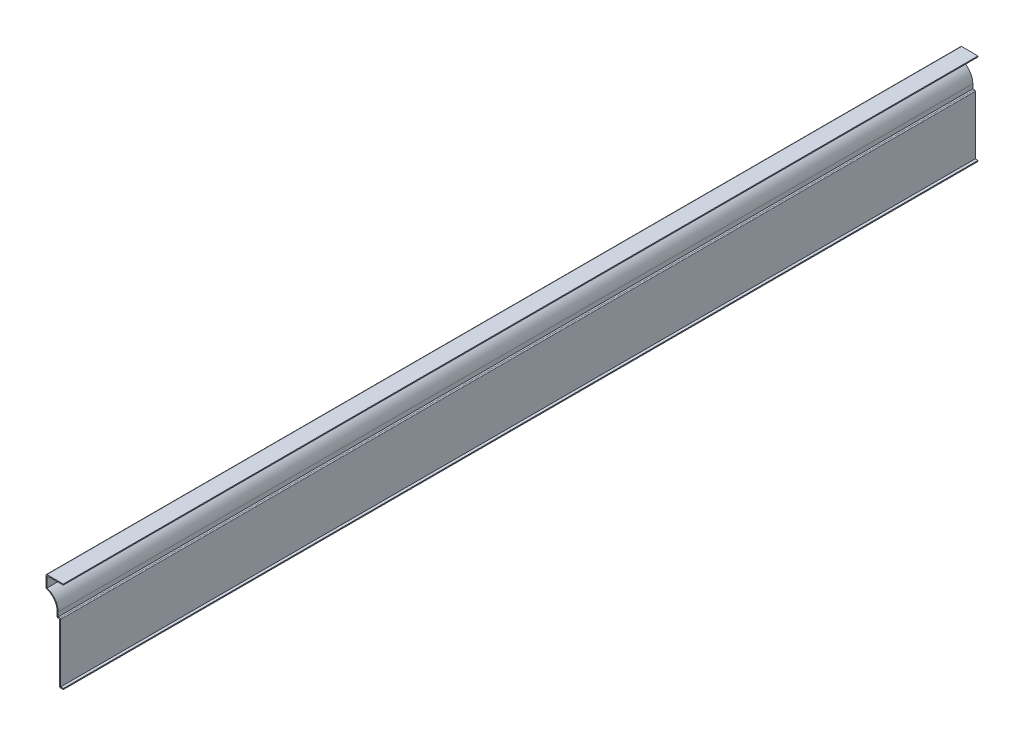
ISO-10303-21;
HEADER;
FILE_DESCRIPTION(('STEP AP214'),'2;1');
FILE_NAME('part.step','',(''),(''),'','','');
FILE_SCHEMA(('AUTOMOTIVE_DESIGN { 1 0 10303 214 1 1 1 1 }'));
ENDSEC;
DATA;
#1=APPLICATION_CONTEXT('core data for automotive mechanical design processes');
#2=APPLICATION_PROTOCOL_DEFINITION('international standard','automotive_design',2000,#1);
#3=PRODUCT_CONTEXT('',#1,'mechanical');
#4=PRODUCT('Part','Part','',(#3));
#5=PRODUCT_RELATED_PRODUCT_CATEGORY('part','',(#4));
#6=PRODUCT_DEFINITION_FORMATION('','',#4);
#7=PRODUCT_DEFINITION_CONTEXT('part definition',#1,'design');
#8=PRODUCT_DEFINITION('design','',#6,#7);
#9=PRODUCT_DEFINITION_SHAPE('','',#8);
#10=(LENGTH_UNIT() NAMED_UNIT(*) SI_UNIT(.MILLI.,.METRE.));
#11=(NAMED_UNIT(*) PLANE_ANGLE_UNIT() SI_UNIT($,.RADIAN.));
#12=(NAMED_UNIT(*) SI_UNIT($,.STERADIAN.) SOLID_ANGLE_UNIT());
#13=UNCERTAINTY_MEASURE_WITH_UNIT(LENGTH_MEASURE(1.E-05),#10,'distance_accuracy_value','');
#14=(GEOMETRIC_REPRESENTATION_CONTEXT(3) GLOBAL_UNCERTAINTY_ASSIGNED_CONTEXT((#13)) GLOBAL_UNIT_ASSIGNED_CONTEXT((#10,
#11,#12)) REPRESENTATION_CONTEXT('',''));
#15=CARTESIAN_POINT('',(0.,0.,0.));
#16=DIRECTION('',(0.,0.,1.));
#17=DIRECTION('',(1.,0.,0.));
#18=AXIS2_PLACEMENT_3D('',#15,#16,#17);
#19=CARTESIAN_POINT('',(-22.225,116.205,-1174.75));
#20=DIRECTION('',(0.,-1.,0.));
#21=DIRECTION('',(1.,0.,0.));
#22=AXIS2_PLACEMENT_3D('',#19,#20,#21);
#23=PLANE('',#22);
#24=DIRECTION('',(1.,0.,0.));
#25=VECTOR('',#24,1.);
#26=CARTESIAN_POINT('',(-22.225,116.205,0.));
#27=LINE('',#26,#25);
#28=CARTESIAN_POINT('',(-20.955,116.205,0.));
#29=VERTEX_POINT('',#28);
#30=CARTESIAN_POINT('',(0.,116.205,0.));
#31=VERTEX_POINT('',#30);
#32=EDGE_CURVE('E242',#29,#31,#27,.T.);
#33=ORIENTED_EDGE('',*,*,#32,.F.);
#34=DIRECTION('',(0.,0.,1.));
#35=VECTOR('',#34,1.);
#36=CARTESIAN_POINT('',(-20.955,116.205,-1174.75));
#37=LINE('',#36,#35);
#38=CARTESIAN_POINT('',(-20.955,116.205,-1174.75));
#39=VERTEX_POINT('',#38);
#40=EDGE_CURVE('E203',#39,#29,#37,.T.);
#41=ORIENTED_EDGE('',*,*,#40,.F.);
#42=DIRECTION('',(1.,0.,0.));
#43=VECTOR('',#42,1.);
#44=CARTESIAN_POINT('',(-22.225,116.205,-1174.75));
#45=LINE('',#44,#43);
#46=CARTESIAN_POINT('',(0.,116.205,-1174.75));
#47=VERTEX_POINT('',#46);
#48=EDGE_CURVE('E185',#39,#47,#45,.T.);
#49=ORIENTED_EDGE('',*,*,#48,.T.);
#50=DIRECTION('',(0.,0.,1.));
#51=VECTOR('',#50,1.);
#52=CARTESIAN_POINT('',(0.,116.205,-1174.75));
#53=LINE('',#52,#51);
#54=EDGE_CURVE('E193',#47,#31,#53,.T.);
#55=ORIENTED_EDGE('',*,*,#54,.T.);
#56=EDGE_LOOP('',(#33,#41,#49,#55));
#57=FACE_BOUND('',#56,.T.);
#58=ADVANCED_FACE('F35',(#57),#23,.T.);
#59=CARTESIAN_POINT('',(-20.955,101.6,-1174.75));
#60=DIRECTION('',(1.,0.,0.));
#61=DIRECTION('',(0.,0.,-1.));
#62=AXIS2_PLACEMENT_3D('',#59,#60,#61);
#63=PLANE('',#62);
#64=DIRECTION('',(0.,1.,0.));
#65=VECTOR('',#64,1.);
#66=CARTESIAN_POINT('',(-20.955,101.6,0.));
#67=LINE('',#66,#65);
#68=CARTESIAN_POINT('',(-20.955,102.558817033746,0.));
#69=VERTEX_POINT('',#68);
#70=EDGE_CURVE('E204',#69,#29,#67,.T.);
#71=ORIENTED_EDGE('',*,*,#70,.F.);
#72=DIRECTION('',(0.,0.,1.));
#73=VECTOR('',#72,1.);
#74=CARTESIAN_POINT('',(-20.955,102.558817033746,-1174.75));
#75=LINE('',#74,#73);
#76=CARTESIAN_POINT('',(-20.955,102.558817033746,-1174.75));
#77=VERTEX_POINT('',#76);
#78=EDGE_CURVE('E279',#77,#69,#75,.T.);
#79=ORIENTED_EDGE('',*,*,#78,.F.);
#80=DIRECTION('',(0.,1.,0.));
#81=VECTOR('',#80,1.);
#82=CARTESIAN_POINT('',(-20.955,101.6,-1174.75));
#83=LINE('',#82,#81);
#84=EDGE_CURVE('E201',#77,#39,#83,.T.);
#85=ORIENTED_EDGE('',*,*,#84,.T.);
#86=ORIENTED_EDGE('',*,*,#40,.T.);
#87=EDGE_LOOP('',(#71,#79,#85,#86));
#88=FACE_BOUND('',#87,.T.);
#89=ADVANCED_FACE('F360',(#88),#63,.T.);
#90=CARTESIAN_POINT('',(-26.9875,83.1549168136872,-1174.75));
#91=DIRECTION('',(0.,0.,1.));
#92=DIRECTION('',(1.,0.,0.));
#93=AXIS2_PLACEMENT_3D('',#90,#91,#92);
#94=CYLINDRICAL_SURFACE('',#93,20.32);
#95=CARTESIAN_POINT('',(-26.9875,83.1549168136872,0.));
#96=DIRECTION('',(0.,0.,1.));
#97=DIRECTION('',(1.,0.,0.));
#98=AXIS2_PLACEMENT_3D('',#95,#96,#97);
#99=CIRCLE('',#98,20.32);
#100=CARTESIAN_POINT('',(-6.6675,83.1549168136872,0.));
#101=VERTEX_POINT('',#100);
#102=EDGE_CURVE('E207',#101,#69,#99,.T.);
#103=ORIENTED_EDGE('',*,*,#102,.F.);
#104=DIRECTION('',(0.,0.,1.));
#105=VECTOR('',#104,1.);
#106=CARTESIAN_POINT('',(-6.6675,83.1549168136872,-1174.75));
#107=LINE('',#106,#105);
#108=CARTESIAN_POINT('',(-6.6675,83.1549168136872,-1174.75));
#109=VERTEX_POINT('',#108);
#110=EDGE_CURVE('E281',#109,#101,#107,.T.);
#111=ORIENTED_EDGE('',*,*,#110,.F.);
#112=CARTESIAN_POINT('',(-26.9875,83.1549168136872,-1174.75));
#113=DIRECTION('',(0.,0.,1.));
#114=DIRECTION('',(1.,0.,0.));
#115=AXIS2_PLACEMENT_3D('',#112,#113,#114);
#116=CIRCLE('',#115,20.32);
#117=EDGE_CURVE('E238',#109,#77,#116,.T.);
#118=ORIENTED_EDGE('',*,*,#117,.T.);
#119=ORIENTED_EDGE('',*,*,#78,.T.);
#120=EDGE_LOOP('',(#103,#111,#118,#119));
#121=FACE_BOUND('',#120,.T.);
#122=ADVANCED_FACE('F428',(#121),#94,.T.);
#123=CARTESIAN_POINT('',(-6.6675,76.2,-1174.75));
#124=DIRECTION('',(1.,0.,0.));
#125=DIRECTION('',(0.,0.,-1.));
#126=AXIS2_PLACEMENT_3D('',#123,#124,#125);
#127=PLANE('',#126);
#128=DIRECTION('',(0.,1.,0.));
#129=VECTOR('',#128,1.);
#130=CARTESIAN_POINT('',(-6.6675,76.2,0.));
#131=LINE('',#130,#129);
#132=CARTESIAN_POINT('',(-6.6675,77.47,0.));
#133=VERTEX_POINT('',#132);
#134=EDGE_CURVE('E272',#133,#101,#131,.T.);
#135=ORIENTED_EDGE('',*,*,#134,.F.);
#136=DIRECTION('',(0.,0.,1.));
#137=VECTOR('',#136,1.);
#138=CARTESIAN_POINT('',(-6.6675,77.47,-1174.75));
#139=LINE('',#138,#137);
#140=CARTESIAN_POINT('',(-6.6675,77.47,-1174.75));
#141=VERTEX_POINT('',#140);
#142=EDGE_CURVE('E283',#141,#133,#139,.T.);
#143=ORIENTED_EDGE('',*,*,#142,.F.);
#144=DIRECTION('',(0.,1.,0.));
#145=VECTOR('',#144,1.);
#146=CARTESIAN_POINT('',(-6.6675,76.2,-1174.75));
#147=LINE('',#146,#145);
#148=EDGE_CURVE('E235',#141,#109,#147,.T.);
#149=ORIENTED_EDGE('',*,*,#148,.T.);
#150=ORIENTED_EDGE('',*,*,#110,.T.);
#151=EDGE_LOOP('',(#135,#143,#149,#150));
#152=FACE_BOUND('',#151,.T.);
#153=ADVANCED_FACE('F368',(#152),#127,.T.);
#154=CARTESIAN_POINT('',(-4.7625,77.47,-1174.75));
#155=DIRECTION('',(0.,1.,0.));
#156=DIRECTION('',(0.,0.,1.));
#157=AXIS2_PLACEMENT_3D('',#154,#155,#156);
#158=PLANE('',#157);
#159=DIRECTION('',(1.,0.,0.));
#160=VECTOR('',#159,1.);
#161=CARTESIAN_POINT('',(-4.7625,77.47,0.));
#162=LINE('',#161,#160);
#163=CARTESIAN_POINT('',(-4.7625,77.47,0.));
#164=VERTEX_POINT('',#163);
#165=EDGE_CURVE('E270',#164,#133,#162,.F.);
#166=ORIENTED_EDGE('',*,*,#165,.F.);
#167=DIRECTION('',(0.,0.,1.));
#168=VECTOR('',#167,1.);
#169=CARTESIAN_POINT('',(-4.7625,77.47,-1174.75));
#170=LINE('',#169,#168);
#171=CARTESIAN_POINT('',(-4.7625,77.47,-1174.75));
#172=VERTEX_POINT('',#171);
#173=EDGE_CURVE('E326',#164,#172,#170,.F.);
#174=ORIENTED_EDGE('',*,*,#173,.T.);
#175=DIRECTION('',(1.,0.,0.));
#176=VECTOR('',#175,1.);
#177=CARTESIAN_POINT('',(-4.7625,77.47,-1174.75));
#178=LINE('',#177,#176);
#179=EDGE_CURVE('E233',#172,#141,#178,.F.);
#180=ORIENTED_EDGE('',*,*,#179,.T.);
#181=ORIENTED_EDGE('',*,*,#142,.T.);
#182=EDGE_LOOP('',(#166,#174,#180,#181));
#183=FACE_BOUND('',#182,.T.);
#184=ADVANCED_FACE('F371',(#183),#158,.T.);
#185=CARTESIAN_POINT('',(-3.4925,0.,-1174.75));
#186=DIRECTION('',(1.,0.,0.));
#187=DIRECTION('',(0.,0.,-1.));
#188=AXIS2_PLACEMENT_3D('',#185,#186,#187);
#189=PLANE('',#188);
#190=DIRECTION('',(0.,1.,0.));
#191=VECTOR('',#190,1.);
#192=CARTESIAN_POINT('',(-3.4925,0.,-1174.75));
#193=LINE('',#192,#191);
#194=CARTESIAN_POINT('',(-3.4925,1.27,-1174.75));
#195=VERTEX_POINT('',#194);
#196=CARTESIAN_POINT('',(-3.4925,76.2,-1174.75));
#197=VERTEX_POINT('',#196);
#198=EDGE_CURVE('E230',#195,#197,#193,.T.);
#199=ORIENTED_EDGE('',*,*,#198,.T.);
#200=DIRECTION('',(0.,0.,1.));
#201=VECTOR('',#200,1.);
#202=CARTESIAN_POINT('',(-3.4925,76.2,-1174.75));
#203=LINE('',#202,#201);
#204=CARTESIAN_POINT('',(-3.4925,76.2,0.));
#205=VERTEX_POINT('',#204);
#206=EDGE_CURVE('E323',#197,#205,#203,.T.);
#207=ORIENTED_EDGE('',*,*,#206,.T.);
#208=DIRECTION('',(0.,1.,0.));
#209=VECTOR('',#208,1.);
#210=CARTESIAN_POINT('',(-3.4925,0.,0.));
#211=LINE('',#210,#209);
#212=CARTESIAN_POINT('',(-3.4925,1.27,0.));
#213=VERTEX_POINT('',#212);
#214=EDGE_CURVE('E267',#213,#205,#211,.T.);
#215=ORIENTED_EDGE('',*,*,#214,.F.);
#216=DIRECTION('',(0.,0.,1.));
#217=VECTOR('',#216,1.);
#218=CARTESIAN_POINT('',(-3.4925,1.27,-1174.75));
#219=LINE('',#218,#217);
#220=EDGE_CURVE('E286',#195,#213,#219,.T.);
#221=ORIENTED_EDGE('',*,*,#220,.F.);
#222=EDGE_LOOP('',(#199,#207,#215,#221));
#223=FACE_BOUND('',#222,.T.);
#224=ADVANCED_FACE('F380',(#223),#189,.T.);
#225=CARTESIAN_POINT('',(0.,1.27,-1174.75));
#226=DIRECTION('',(0.,1.,0.));
#227=DIRECTION('',(0.,0.,1.));
#228=AXIS2_PLACEMENT_3D('',#225,#226,#227);
#229=PLANE('',#228);
#230=DIRECTION('',(1.,0.,0.));
#231=VECTOR('',#230,1.);
#232=CARTESIAN_POINT('',(0.,1.27,0.));
#233=LINE('',#232,#231);
#234=CARTESIAN_POINT('',(0.,1.27,0.));
#235=VERTEX_POINT('',#234);
#236=EDGE_CURVE('E264',#235,#213,#233,.F.);
#237=ORIENTED_EDGE('',*,*,#236,.F.);
#238=DIRECTION('',(0.,0.,1.));
#239=VECTOR('',#238,1.);
#240=CARTESIAN_POINT('',(0.,1.27,-1174.75));
#241=LINE('',#240,#239);
#242=CARTESIAN_POINT('',(0.,1.27,-1174.75));
#243=VERTEX_POINT('',#242);
#244=EDGE_CURVE('E288',#243,#235,#241,.T.);
#245=ORIENTED_EDGE('',*,*,#244,.F.);
#246=DIRECTION('',(1.,0.,0.));
#247=VECTOR('',#246,1.);
#248=CARTESIAN_POINT('',(0.,1.27,-1174.75));
#249=LINE('',#248,#247);
#250=EDGE_CURVE('E227',#243,#195,#249,.F.);
#251=ORIENTED_EDGE('',*,*,#250,.T.);
#252=ORIENTED_EDGE('',*,*,#220,.T.);
#253=EDGE_LOOP('',(#237,#245,#251,#252));
#254=FACE_BOUND('',#253,.T.);
#255=ADVANCED_FACE('F385',(#254),#229,.T.);
#256=CARTESIAN_POINT('',(0.,1.27,-1174.75));
#257=DIRECTION('',(-1.,0.,0.));
#258=DIRECTION('',(0.,0.,1.));
#259=AXIS2_PLACEMENT_3D('',#256,#257,#258);
#260=PLANE('',#259);
#261=DIRECTION('',(0.,-1.,0.));
#262=VECTOR('',#261,1.);
#263=CARTESIAN_POINT('',(0.,1.27,0.));
#264=LINE('',#263,#262);
#265=CARTESIAN_POINT('',(0.,0.,0.));
#266=VERTEX_POINT('',#265);
#267=EDGE_CURVE('E262',#235,#266,#264,.T.);
#268=ORIENTED_EDGE('',*,*,#267,.T.);
#269=DIRECTION('',(0.,0.,1.));
#270=VECTOR('',#269,1.);
#271=CARTESIAN_POINT('',(0.,0.,-1174.75));
#272=LINE('',#271,#270);
#273=CARTESIAN_POINT('',(0.,0.,-1174.75));
#274=VERTEX_POINT('',#273);
#275=EDGE_CURVE('E290',#274,#266,#272,.T.);
#276=ORIENTED_EDGE('',*,*,#275,.F.);
#277=DIRECTION('',(0.,-1.,0.));
#278=VECTOR('',#277,1.);
#279=CARTESIAN_POINT('',(0.,1.27,-1174.75));
#280=LINE('',#279,#278);
#281=EDGE_CURVE('E225',#243,#274,#280,.T.);
#282=ORIENTED_EDGE('',*,*,#281,.F.);
#283=ORIENTED_EDGE('',*,*,#244,.T.);
#284=EDGE_LOOP('',(#268,#276,#282,#283));
#285=FACE_BOUND('',#284,.T.);
#286=ADVANCED_FACE('F392',(#285),#260,.F.);
#287=CARTESIAN_POINT('',(0.,0.,-1174.75));
#288=DIRECTION('',(0.,1.,0.));
#289=DIRECTION('',(0.,0.,1.));
#290=AXIS2_PLACEMENT_3D('',#287,#288,#289);
#291=PLANE('',#290);
#292=DIRECTION('',(-1.,0.,0.));
#293=VECTOR('',#292,1.);
#294=CARTESIAN_POINT('',(0.,0.,0.));
#295=LINE('',#294,#293);
#296=CARTESIAN_POINT('',(-3.4925,0.,0.));
#297=VERTEX_POINT('',#296);
#298=EDGE_CURVE('E259',#266,#297,#295,.T.);
#299=ORIENTED_EDGE('',*,*,#298,.T.);
#300=DIRECTION('',(0.,0.,1.));
#301=VECTOR('',#300,1.);
#302=CARTESIAN_POINT('',(-3.4925,0.,-1174.75));
#303=LINE('',#302,#301);
#304=CARTESIAN_POINT('',(-3.4925,0.,-1174.75));
#305=VERTEX_POINT('',#304);
#306=EDGE_CURVE('E312',#297,#305,#303,.F.);
#307=ORIENTED_EDGE('',*,*,#306,.T.);
#308=DIRECTION('',(-1.,0.,0.));
#309=VECTOR('',#308,1.);
#310=CARTESIAN_POINT('',(0.,0.,-1174.75));
#311=LINE('',#310,#309);
#312=EDGE_CURVE('E223',#274,#305,#311,.T.);
#313=ORIENTED_EDGE('',*,*,#312,.F.);
#314=ORIENTED_EDGE('',*,*,#275,.T.);
#315=EDGE_LOOP('',(#299,#307,#313,#314));
#316=FACE_BOUND('',#315,.T.);
#317=ADVANCED_FACE('F394',(#316),#291,.F.);
#318=CARTESIAN_POINT('',(-4.7625,0.,-1174.75));
#319=DIRECTION('',(1.,0.,0.));
#320=DIRECTION('',(0.,0.,-1.));
#321=AXIS2_PLACEMENT_3D('',#318,#319,#320);
#322=PLANE('',#321);
#323=DIRECTION('',(0.,1.,0.));
#324=VECTOR('',#323,1.);
#325=CARTESIAN_POINT('',(-4.7625,0.,-1174.75));
#326=LINE('',#325,#324);
#327=CARTESIAN_POINT('',(-4.7625,1.27,-1174.75));
#328=VERTEX_POINT('',#327);
#329=CARTESIAN_POINT('',(-4.7625,76.2,-1174.75));
#330=VERTEX_POINT('',#329);
#331=EDGE_CURVE('E221',#328,#330,#326,.T.);
#332=ORIENTED_EDGE('',*,*,#331,.F.);
#333=DIRECTION('',(0.,0.,1.));
#334=VECTOR('',#333,1.);
#335=CARTESIAN_POINT('',(-4.7625,1.27,-1174.75));
#336=LINE('',#335,#334);
#337=CARTESIAN_POINT('',(-4.7625,1.27,0.));
#338=VERTEX_POINT('',#337);
#339=EDGE_CURVE('E278',#328,#338,#336,.T.);
#340=ORIENTED_EDGE('',*,*,#339,.T.);
#341=DIRECTION('',(0.,1.,0.));
#342=VECTOR('',#341,1.);
#343=CARTESIAN_POINT('',(-4.7625,0.,0.));
#344=LINE('',#343,#342);
#345=CARTESIAN_POINT('',(-4.7625,76.2,0.));
#346=VERTEX_POINT('',#345);
#347=EDGE_CURVE('E257',#338,#346,#344,.T.);
#348=ORIENTED_EDGE('',*,*,#347,.T.);
#349=DIRECTION('',(0.,0.,1.));
#350=VECTOR('',#349,1.);
#351=CARTESIAN_POINT('',(-4.7625,76.2,-1174.75));
#352=LINE('',#351,#350);
#353=EDGE_CURVE('E293',#330,#346,#352,.T.);
#354=ORIENTED_EDGE('',*,*,#353,.F.);
#355=EDGE_LOOP('',(#332,#340,#348,#354));
#356=FACE_BOUND('',#355,.T.);
#357=ADVANCED_FACE('F402',(#356),#322,.F.);
#358=CARTESIAN_POINT('',(-4.7625,76.2,-1174.75));
#359=DIRECTION('',(0.,1.,0.));
#360=DIRECTION('',(0.,0.,1.));
#361=AXIS2_PLACEMENT_3D('',#358,#359,#360);
#362=PLANE('',#361);
#363=DIRECTION('',(-1.,0.,0.));
#364=VECTOR('',#363,1.);
#365=CARTESIAN_POINT('',(-4.7625,76.2,0.));
#366=LINE('',#365,#364);
#367=CARTESIAN_POINT('',(-6.6675,76.2,0.));
#368=VERTEX_POINT('',#367);
#369=EDGE_CURVE('E254',#346,#368,#366,.T.);
#370=ORIENTED_EDGE('',*,*,#369,.T.);
#371=DIRECTION('',(0.,0.,1.));
#372=VECTOR('',#371,1.);
#373=CARTESIAN_POINT('',(-6.6675,76.2,-1174.75));
#374=LINE('',#373,#372);
#375=CARTESIAN_POINT('',(-6.6675,76.2,-1174.75));
#376=VERTEX_POINT('',#375);
#377=EDGE_CURVE('E331',#368,#376,#374,.F.);
#378=ORIENTED_EDGE('',*,*,#377,.T.);
#379=DIRECTION('',(-1.,0.,0.));
#380=VECTOR('',#379,1.);
#381=CARTESIAN_POINT('',(-4.7625,76.2,-1174.75));
#382=LINE('',#381,#380);
#383=EDGE_CURVE('E218',#330,#376,#382,.T.);
#384=ORIENTED_EDGE('',*,*,#383,.F.);
#385=ORIENTED_EDGE('',*,*,#353,.T.);
#386=EDGE_LOOP('',(#370,#378,#384,#385));
#387=FACE_BOUND('',#386,.T.);
#388=ADVANCED_FACE('F406',(#387),#362,.F.);
#389=CARTESIAN_POINT('',(-7.9375,76.2,-1174.75));
#390=DIRECTION('',(1.,0.,0.));
#391=DIRECTION('',(0.,0.,-1.));
#392=AXIS2_PLACEMENT_3D('',#389,#390,#391);
#393=PLANE('',#392);
#394=DIRECTION('',(0.,1.,0.));
#395=VECTOR('',#394,1.);
#396=CARTESIAN_POINT('',(-7.9375,76.2,-1174.75));
#397=LINE('',#396,#395);
#398=CARTESIAN_POINT('',(-7.9375,77.47,-1174.75));
#399=VERTEX_POINT('',#398);
#400=CARTESIAN_POINT('',(-7.9375,83.1549168136872,-1174.75));
#401=VERTEX_POINT('',#400);
#402=EDGE_CURVE('E216',#399,#401,#397,.T.);
#403=ORIENTED_EDGE('',*,*,#402,.F.);
#404=DIRECTION('',(0.,0.,1.));
#405=VECTOR('',#404,1.);
#406=CARTESIAN_POINT('',(-7.9375,77.47,-1174.75));
#407=LINE('',#406,#405);
#408=CARTESIAN_POINT('',(-7.9375,77.47,0.));
#409=VERTEX_POINT('',#408);
#410=EDGE_CURVE('E328',#399,#409,#407,.T.);
#411=ORIENTED_EDGE('',*,*,#410,.T.);
#412=DIRECTION('',(0.,1.,0.));
#413=VECTOR('',#412,1.);
#414=CARTESIAN_POINT('',(-7.9375,76.2,0.));
#415=LINE('',#414,#413);
#416=CARTESIAN_POINT('',(-7.9375,83.1549168136872,0.));
#417=VERTEX_POINT('',#416);
#418=EDGE_CURVE('E252',#409,#417,#415,.T.);
#419=ORIENTED_EDGE('',*,*,#418,.T.);
#420=DIRECTION('',(0.,0.,1.));
#421=VECTOR('',#420,1.);
#422=CARTESIAN_POINT('',(-7.9375,83.1549168136872,-1174.75));
#423=LINE('',#422,#421);
#424=EDGE_CURVE('E296',#401,#417,#423,.T.);
#425=ORIENTED_EDGE('',*,*,#424,.F.);
#426=EDGE_LOOP('',(#403,#411,#419,#425));
#427=FACE_BOUND('',#426,.T.);
#428=ADVANCED_FACE('F414',(#427),#393,.F.);
#429=CARTESIAN_POINT('',(-26.9875,83.1549168136872,-1174.75));
#430=DIRECTION('',(0.,0.,1.));
#431=DIRECTION('',(1.,0.,0.));
#432=AXIS2_PLACEMENT_3D('',#429,#430,#431);
#433=CYLINDRICAL_SURFACE('',#432,19.05);
#434=CARTESIAN_POINT('',(-26.9875,83.1549168136872,0.));
#435=DIRECTION('',(0.,0.,1.));
#436=DIRECTION('',(1.,0.,0.));
#437=AXIS2_PLACEMENT_3D('',#434,#435,#436);
#438=CIRCLE('',#437,19.05);
#439=CARTESIAN_POINT('',(-21.33203125,101.346073269992,0.));
#440=VERTEX_POINT('',#439);
#441=EDGE_CURVE('E249',#417,#440,#438,.T.);
#442=ORIENTED_EDGE('',*,*,#441,.T.);
#443=DIRECTION('',(0.,0.,1.));
#444=VECTOR('',#443,1.);
#445=CARTESIAN_POINT('',(-21.33203125,101.346073269992,-1174.75));
#446=LINE('',#445,#444);
#447=CARTESIAN_POINT('',(-21.33203125,101.346073269992,-1174.75));
#448=VERTEX_POINT('',#447);
#449=EDGE_CURVE('E43',#440,#448,#446,.F.);
#450=ORIENTED_EDGE('',*,*,#449,.T.);
#451=CARTESIAN_POINT('',(-26.9875,83.1549168136872,-1174.75));
#452=DIRECTION('',(0.,0.,1.));
#453=DIRECTION('',(1.,0.,0.));
#454=AXIS2_PLACEMENT_3D('',#451,#452,#453);
#455=CIRCLE('',#454,19.05);
#456=EDGE_CURVE('E213',#401,#448,#455,.T.);
#457=ORIENTED_EDGE('',*,*,#456,.F.);
#458=ORIENTED_EDGE('',*,*,#424,.T.);
#459=EDGE_LOOP('',(#442,#450,#457,#458));
#460=FACE_BOUND('',#459,.T.);
#461=ADVANCED_FACE('F339',(#460),#433,.F.);
#462=CARTESIAN_POINT('',(-22.225,101.6,-1174.75));
#463=DIRECTION('',(1.,0.,0.));
#464=DIRECTION('',(0.,0.,-1.));
#465=AXIS2_PLACEMENT_3D('',#462,#463,#464);
#466=PLANE('',#465);
#467=DIRECTION('',(0.,1.,0.));
#468=VECTOR('',#467,1.);
#469=CARTESIAN_POINT('',(-22.225,101.6,-1174.75));
#470=LINE('',#469,#468);
#471=CARTESIAN_POINT('',(-22.225,102.558817033746,-1174.75));
#472=VERTEX_POINT('',#471);
#473=CARTESIAN_POINT('',(-22.225,116.205,-1174.75));
#474=VERTEX_POINT('',#473);
#475=EDGE_CURVE('E211',#472,#474,#470,.T.);
#476=ORIENTED_EDGE('',*,*,#475,.F.);
#477=DIRECTION('',(0.,0.,1.));
#478=VECTOR('',#477,1.);
#479=CARTESIAN_POINT('',(-22.225,102.558817033746,-1174.75));
#480=LINE('',#479,#478);
#481=CARTESIAN_POINT('',(-22.225,102.558817033746,0.));
#482=VERTEX_POINT('',#481);
#483=EDGE_CURVE('E334',#472,#482,#480,.T.);
#484=ORIENTED_EDGE('',*,*,#483,.T.);
#485=DIRECTION('',(0.,1.,0.));
#486=VECTOR('',#485,1.);
#487=CARTESIAN_POINT('',(-22.225,101.6,0.));
#488=LINE('',#487,#486);
#489=CARTESIAN_POINT('',(-22.225,116.205,0.));
#490=VERTEX_POINT('',#489);
#491=EDGE_CURVE('E247',#482,#490,#488,.T.);
#492=ORIENTED_EDGE('',*,*,#491,.T.);
#493=DIRECTION('',(0.,0.,1.));
#494=VECTOR('',#493,1.);
#495=CARTESIAN_POINT('',(-22.225,116.205,-1174.75));
#496=LINE('',#495,#494);
#497=EDGE_CURVE('E58',#490,#474,#496,.F.);
#498=ORIENTED_EDGE('',*,*,#497,.T.);
#499=EDGE_LOOP('',(#476,#484,#492,#498));
#500=FACE_BOUND('',#499,.T.);
#501=ADVANCED_FACE('F348',(#500),#466,.F.);
#502=CARTESIAN_POINT('',(-22.225,117.475,-1174.75));
#503=DIRECTION('',(0.,-1.,0.));
#504=DIRECTION('',(1.,0.,0.));
#505=AXIS2_PLACEMENT_3D('',#502,#503,#504);
#506=PLANE('',#505);
#507=DIRECTION('',(1.,0.,0.));
#508=VECTOR('',#507,1.);
#509=CARTESIAN_POINT('',(-22.225,117.475,-1174.75));
#510=LINE('',#509,#508);
#511=CARTESIAN_POINT('',(-20.955,117.475,-1174.75));
#512=VERTEX_POINT('',#511);
#513=CARTESIAN_POINT('',(0.,117.475,-1174.75));
#514=VERTEX_POINT('',#513);
#515=EDGE_CURVE('E187',#512,#514,#510,.T.);
#516=ORIENTED_EDGE('',*,*,#515,.F.);
#517=DIRECTION('',(0.,0.,1.));
#518=VECTOR('',#517,1.);
#519=CARTESIAN_POINT('',(-20.955,117.475,-1174.75));
#520=LINE('',#519,#518);
#521=CARTESIAN_POINT('',(-20.955,117.475,0.));
#522=VERTEX_POINT('',#521);
#523=EDGE_CURVE('E11',#512,#522,#520,.T.);
#524=ORIENTED_EDGE('',*,*,#523,.T.);
#525=DIRECTION('',(1.,0.,0.));
#526=VECTOR('',#525,1.);
#527=CARTESIAN_POINT('',(-22.225,117.475,0.));
#528=LINE('',#527,#526);
#529=CARTESIAN_POINT('',(0.,117.475,0.));
#530=VERTEX_POINT('',#529);
#531=EDGE_CURVE('E245',#522,#530,#528,.T.);
#532=ORIENTED_EDGE('',*,*,#531,.T.);
#533=DIRECTION('',(0.,0.,1.));
#534=VECTOR('',#533,1.);
#535=CARTESIAN_POINT('',(0.,117.475,-1174.75));
#536=LINE('',#535,#534);
#537=EDGE_CURVE('E200',#514,#530,#536,.T.);
#538=ORIENTED_EDGE('',*,*,#537,.F.);
#539=EDGE_LOOP('',(#516,#524,#532,#538));
#540=FACE_BOUND('',#539,.T.);
#541=ADVANCED_FACE('F356',(#540),#506,.F.);
#542=CARTESIAN_POINT('',(0.,117.475,-1174.75));
#543=DIRECTION('',(-1.,0.,0.));
#544=DIRECTION('',(0.,0.,1.));
#545=AXIS2_PLACEMENT_3D('',#542,#543,#544);
#546=PLANE('',#545);
#547=DIRECTION('',(0.,-1.,0.));
#548=VECTOR('',#547,1.);
#549=CARTESIAN_POINT('',(0.,117.475,0.));
#550=LINE('',#549,#548);
#551=EDGE_CURVE('E196',#530,#31,#550,.T.);
#552=ORIENTED_EDGE('',*,*,#551,.T.);
#553=ORIENTED_EDGE('',*,*,#54,.F.);
#554=DIRECTION('',(0.,-1.,0.));
#555=VECTOR('',#554,1.);
#556=CARTESIAN_POINT('',(0.,117.475,-1174.75));
#557=LINE('',#556,#555);
#558=EDGE_CURVE('E179',#514,#47,#557,.T.);
#559=ORIENTED_EDGE('',*,*,#558,.F.);
#560=ORIENTED_EDGE('',*,*,#537,.T.);
#561=EDGE_LOOP('',(#552,#553,#559,#560));
#562=FACE_BOUND('',#561,.T.);
#563=ADVANCED_FACE('F194',(#562),#546,.F.);
#564=CARTESIAN_POINT('',(-26.9875,83.1549168136872,-1174.75));
#565=DIRECTION('',(0.,0.,1.));
#566=DIRECTION('',(1.,0.,0.));
#567=AXIS2_PLACEMENT_3D('',#564,#565,#566);
#568=PLANE('',#567);
#569=ORIENTED_EDGE('',*,*,#312,.T.);
#570=CARTESIAN_POINT('',(-3.4925,1.27,-1174.75));
#571=DIRECTION('',(0.,0.,1.));
#572=DIRECTION('',(1.,0.,0.));
#573=AXIS2_PLACEMENT_3D('',#570,#571,#572);
#574=CIRCLE('',#573,1.27);
#575=EDGE_CURVE('E321',#305,#328,#574,.F.);
#576=ORIENTED_EDGE('',*,*,#575,.T.);
#577=ORIENTED_EDGE('',*,*,#331,.T.);
#578=ORIENTED_EDGE('',*,*,#383,.T.);
#579=CARTESIAN_POINT('',(-6.6675,77.47,-1174.75));
#580=DIRECTION('',(0.,0.,1.));
#581=DIRECTION('',(1.,0.,0.));
#582=AXIS2_PLACEMENT_3D('',#579,#580,#581);
#583=CIRCLE('',#582,1.27);
#584=EDGE_CURVE('E317',#376,#399,#583,.F.);
#585=ORIENTED_EDGE('',*,*,#584,.T.);
#586=ORIENTED_EDGE('',*,*,#402,.T.);
#587=ORIENTED_EDGE('',*,*,#456,.T.);
#588=CARTESIAN_POINT('',(-20.955,102.558817033746,-1174.75));
#589=DIRECTION('',(0.,0.,1.));
#590=DIRECTION('',(1.,0.,0.));
#591=AXIS2_PLACEMENT_3D('',#588,#589,#590);
#592=CIRCLE('',#591,1.27);
#593=EDGE_CURVE('E315',#448,#472,#592,.F.);
#594=ORIENTED_EDGE('',*,*,#593,.T.);
#595=ORIENTED_EDGE('',*,*,#475,.T.);
#596=CARTESIAN_POINT('',(-20.955,116.205,-1174.75));
#597=DIRECTION('',(0.,0.,1.));
#598=DIRECTION('',(1.,0.,0.));
#599=AXIS2_PLACEMENT_3D('',#596,#597,#598);
#600=CIRCLE('',#599,1.27);
#601=EDGE_CURVE('E50',#474,#512,#600,.F.);
#602=ORIENTED_EDGE('',*,*,#601,.T.);
#603=ORIENTED_EDGE('',*,*,#515,.T.);
#604=ORIENTED_EDGE('',*,*,#558,.T.);
#605=ORIENTED_EDGE('',*,*,#48,.F.);
#606=ORIENTED_EDGE('',*,*,#84,.F.);
#607=ORIENTED_EDGE('',*,*,#117,.F.);
#608=ORIENTED_EDGE('',*,*,#148,.F.);
#609=ORIENTED_EDGE('',*,*,#179,.F.);
#610=CARTESIAN_POINT('',(-4.7625,76.2,-1174.75));
#611=DIRECTION('',(0.,0.,1.));
#612=DIRECTION('',(1.,0.,0.));
#613=AXIS2_PLACEMENT_3D('',#610,#611,#612);
#614=CIRCLE('',#613,1.27);
#615=EDGE_CURVE('E319',#172,#197,#614,.F.);
#616=ORIENTED_EDGE('',*,*,#615,.T.);
#617=ORIENTED_EDGE('',*,*,#198,.F.);
#618=ORIENTED_EDGE('',*,*,#250,.F.);
#619=ORIENTED_EDGE('',*,*,#281,.T.);
#620=EDGE_LOOP('',(#569,#576,#577,#578,#585,#586,#587,#594,#595,#602,#603,#604,#605,#606,#607,
#608,#609,#616,#617,#618,#619));
#621=FACE_BOUND('',#620,.T.);
#622=ADVANCED_FACE('F182',(#621),#568,.F.);
#623=CARTESIAN_POINT('',(-26.9875,83.1549168136872,0.));
#624=DIRECTION('',(0.,0.,1.));
#625=DIRECTION('',(1.,0.,0.));
#626=AXIS2_PLACEMENT_3D('',#623,#624,#625);
#627=PLANE('',#626);
#628=ORIENTED_EDGE('',*,*,#347,.F.);
#629=CARTESIAN_POINT('',(-3.4925,1.27,0.));
#630=DIRECTION('',(0.,0.,1.));
#631=DIRECTION('',(1.,0.,0.));
#632=AXIS2_PLACEMENT_3D('',#629,#630,#631);
#633=CIRCLE('',#632,1.27);
#634=EDGE_CURVE('E310',#338,#297,#633,.T.);
#635=ORIENTED_EDGE('',*,*,#634,.T.);
#636=ORIENTED_EDGE('',*,*,#298,.F.);
#637=ORIENTED_EDGE('',*,*,#267,.F.);
#638=ORIENTED_EDGE('',*,*,#236,.T.);
#639=ORIENTED_EDGE('',*,*,#214,.T.);
#640=CARTESIAN_POINT('',(-4.7625,76.2,0.));
#641=DIRECTION('',(0.,0.,1.));
#642=DIRECTION('',(1.,0.,0.));
#643=AXIS2_PLACEMENT_3D('',#640,#641,#642);
#644=CIRCLE('',#643,1.27);
#645=EDGE_CURVE('E308',#205,#164,#644,.T.);
#646=ORIENTED_EDGE('',*,*,#645,.T.);
#647=ORIENTED_EDGE('',*,*,#165,.T.);
#648=ORIENTED_EDGE('',*,*,#134,.T.);
#649=ORIENTED_EDGE('',*,*,#102,.T.);
#650=ORIENTED_EDGE('',*,*,#70,.T.);
#651=ORIENTED_EDGE('',*,*,#32,.T.);
#652=ORIENTED_EDGE('',*,*,#551,.F.);
#653=ORIENTED_EDGE('',*,*,#531,.F.);
#654=CARTESIAN_POINT('',(-20.955,116.205,0.));
#655=DIRECTION('',(0.,0.,1.));
#656=DIRECTION('',(1.,0.,0.));
#657=AXIS2_PLACEMENT_3D('',#654,#655,#656);
#658=CIRCLE('',#657,1.27);
#659=EDGE_CURVE('E302',#522,#490,#658,.T.);
#660=ORIENTED_EDGE('',*,*,#659,.T.);
#661=ORIENTED_EDGE('',*,*,#491,.F.);
#662=CARTESIAN_POINT('',(-20.955,102.558817033746,0.));
#663=DIRECTION('',(0.,0.,1.));
#664=DIRECTION('',(1.,0.,0.));
#665=AXIS2_PLACEMENT_3D('',#662,#663,#664);
#666=CIRCLE('',#665,1.27);
#667=EDGE_CURVE('E304',#482,#440,#666,.T.);
#668=ORIENTED_EDGE('',*,*,#667,.T.);
#669=ORIENTED_EDGE('',*,*,#441,.F.);
#670=ORIENTED_EDGE('',*,*,#418,.F.);
#671=CARTESIAN_POINT('',(-6.6675,77.47,0.));
#672=DIRECTION('',(0.,0.,1.));
#673=DIRECTION('',(1.,0.,0.));
#674=AXIS2_PLACEMENT_3D('',#671,#672,#673);
#675=CIRCLE('',#674,1.27);
#676=EDGE_CURVE('E306',#409,#368,#675,.T.);
#677=ORIENTED_EDGE('',*,*,#676,.T.);
#678=ORIENTED_EDGE('',*,*,#369,.F.);
#679=EDGE_LOOP('',(#628,#635,#636,#637,#638,#639,#646,#647,#648,#649,#650,#651,#652,#653,#660,
#661,#668,#669,#670,#677,#678));
#680=FACE_BOUND('',#679,.T.);
#681=ADVANCED_FACE('F351',(#680),#627,.T.);
#682=CARTESIAN_POINT('',(-3.4925,1.27,-1174.75));
#683=DIRECTION('',(0.,0.,1.));
#684=DIRECTION('',(1.,0.,0.));
#685=AXIS2_PLACEMENT_3D('',#682,#683,#684);
#686=CYLINDRICAL_SURFACE('',#685,1.27);
#687=ORIENTED_EDGE('',*,*,#575,.F.);
#688=ORIENTED_EDGE('',*,*,#306,.F.);
#689=ORIENTED_EDGE('',*,*,#634,.F.);
#690=ORIENTED_EDGE('',*,*,#339,.F.);
#691=EDGE_LOOP('',(#687,#688,#689,#690));
#692=FACE_BOUND('',#691,.T.);
#693=ADVANCED_FACE('F397',(#692),#686,.T.);
#694=CARTESIAN_POINT('',(-4.7625,76.2,-1174.75));
#695=DIRECTION('',(0.,0.,1.));
#696=DIRECTION('',(1.,0.,0.));
#697=AXIS2_PLACEMENT_3D('',#694,#695,#696);
#698=CYLINDRICAL_SURFACE('',#697,1.27);
#699=ORIENTED_EDGE('',*,*,#615,.F.);
#700=ORIENTED_EDGE('',*,*,#173,.F.);
#701=ORIENTED_EDGE('',*,*,#645,.F.);
#702=ORIENTED_EDGE('',*,*,#206,.F.);
#703=EDGE_LOOP('',(#699,#700,#701,#702));
#704=FACE_BOUND('',#703,.T.);
#705=ADVANCED_FACE('F377',(#704),#698,.T.);
#706=CARTESIAN_POINT('',(-6.6675,77.47,-1174.75));
#707=DIRECTION('',(0.,0.,1.));
#708=DIRECTION('',(1.,0.,0.));
#709=AXIS2_PLACEMENT_3D('',#706,#707,#708);
#710=CYLINDRICAL_SURFACE('',#709,1.27);
#711=ORIENTED_EDGE('',*,*,#584,.F.);
#712=ORIENTED_EDGE('',*,*,#377,.F.);
#713=ORIENTED_EDGE('',*,*,#676,.F.);
#714=ORIENTED_EDGE('',*,*,#410,.F.);
#715=EDGE_LOOP('',(#711,#712,#713,#714));
#716=FACE_BOUND('',#715,.T.);
#717=ADVANCED_FACE('F411',(#716),#710,.T.);
#718=CARTESIAN_POINT('',(-20.955,102.558817033746,-1174.75));
#719=DIRECTION('',(0.,0.,1.));
#720=DIRECTION('',(1.,0.,0.));
#721=AXIS2_PLACEMENT_3D('',#718,#719,#720);
#722=CYLINDRICAL_SURFACE('',#721,1.27);
#723=ORIENTED_EDGE('',*,*,#593,.F.);
#724=ORIENTED_EDGE('',*,*,#449,.F.);
#725=ORIENTED_EDGE('',*,*,#667,.F.);
#726=ORIENTED_EDGE('',*,*,#483,.F.);
#727=EDGE_LOOP('',(#723,#724,#725,#726));
#728=FACE_BOUND('',#727,.T.);
#729=ADVANCED_FACE('F346',(#728),#722,.T.);
#730=CARTESIAN_POINT('',(-20.955,116.205,-1174.75));
#731=DIRECTION('',(0.,0.,1.));
#732=DIRECTION('',(1.,0.,0.));
#733=AXIS2_PLACEMENT_3D('',#730,#731,#732);
#734=CYLINDRICAL_SURFACE('',#733,1.27);
#735=ORIENTED_EDGE('',*,*,#601,.F.);
#736=ORIENTED_EDGE('',*,*,#497,.F.);
#737=ORIENTED_EDGE('',*,*,#659,.F.);
#738=ORIENTED_EDGE('',*,*,#523,.F.);
#739=EDGE_LOOP('',(#735,#736,#737,#738));
#740=FACE_BOUND('',#739,.T.);
#741=ADVANCED_FACE('F37',(#740),#734,.T.);
#742=CLOSED_SHELL('',(#58,#89,#122,#153,#184,#224,#255,#286,#317,#357,#388,#428,#461,#501,#541,
#563,#622,#681,#693,#705,#717,#729,#741));
#743=MANIFOLD_SOLID_BREP('B2',#742);
#744=ADVANCED_BREP_SHAPE_REPRESENTATION('',(#18,#743),#14);
#745=SHAPE_DEFINITION_REPRESENTATION(#9,#744);
ENDSEC;
END-ISO-10303-21;
